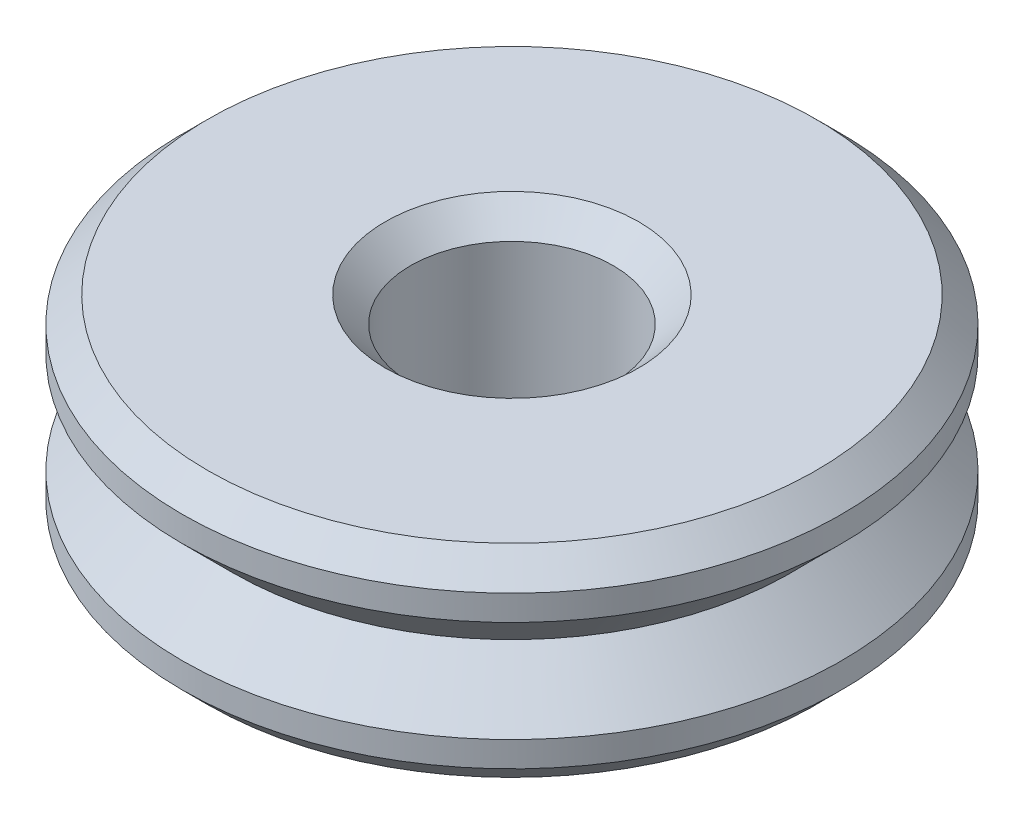
ISO-10303-21;
HEADER;
FILE_DESCRIPTION(('STEP AP214'),'2;1');
FILE_NAME('part.step','',(''),(''),'','','');
FILE_SCHEMA(('AUTOMOTIVE_DESIGN { 1 0 10303 214 1 1 1 1 }'));
ENDSEC;
DATA;
#1=APPLICATION_CONTEXT('core data for automotive mechanical design processes');
#2=APPLICATION_PROTOCOL_DEFINITION('international standard','automotive_design',2000,#1);
#3=PRODUCT_CONTEXT('',#1,'mechanical');
#4=PRODUCT('Part','Part','',(#3));
#5=PRODUCT_RELATED_PRODUCT_CATEGORY('part','',(#4));
#6=PRODUCT_DEFINITION_FORMATION('','',#4);
#7=PRODUCT_DEFINITION_CONTEXT('part definition',#1,'design');
#8=PRODUCT_DEFINITION('design','',#6,#7);
#9=PRODUCT_DEFINITION_SHAPE('','',#8);
#10=(LENGTH_UNIT() NAMED_UNIT(*) SI_UNIT(.MILLI.,.METRE.));
#11=(NAMED_UNIT(*) PLANE_ANGLE_UNIT() SI_UNIT($,.RADIAN.));
#12=(NAMED_UNIT(*) SI_UNIT($,.STERADIAN.) SOLID_ANGLE_UNIT());
#13=UNCERTAINTY_MEASURE_WITH_UNIT(LENGTH_MEASURE(1.E-05),#10,'distance_accuracy_value','');
#14=(GEOMETRIC_REPRESENTATION_CONTEXT(3) GLOBAL_UNCERTAINTY_ASSIGNED_CONTEXT((#13)) GLOBAL_UNIT_ASSIGNED_CONTEXT((#10,
#11,#12)) REPRESENTATION_CONTEXT('',''));
#15=CARTESIAN_POINT('',(0.,0.,0.));
#16=DIRECTION('',(0.,0.,1.));
#17=DIRECTION('',(1.,0.,0.));
#18=AXIS2_PLACEMENT_3D('',#15,#16,#17);
#19=CARTESIAN_POINT('',(0.,4.,0.));
#20=DIRECTION('',(0.,-1.,0.));
#21=DIRECTION('',(0.,0.,-1.));
#22=AXIS2_PLACEMENT_3D('',#19,#20,#21);
#23=CYLINDRICAL_SURFACE('',#22,6.5);
#24=CARTESIAN_POINT('',(0.,3.5,0.));
#25=DIRECTION('',(0.,1.,0.));
#26=DIRECTION('',(0.,0.,1.));
#27=AXIS2_PLACEMENT_3D('',#24,#25,#26);
#28=CIRCLE('',#27,6.5);
#29=CARTESIAN_POINT('',(0.,3.5,6.5));
#30=VERTEX_POINT('',#29);
#31=EDGE_CURVE('E10',#30,#30,#28,.F.);
#32=ORIENTED_EDGE('',*,*,#31,.T.);
#33=EDGE_LOOP('',(#32));
#34=FACE_BOUND('',#33,.T.);
#35=CARTESIAN_POINT('',(0.,3.,0.));
#36=DIRECTION('',(0.,1.,0.));
#37=DIRECTION('',(0.,0.,1.));
#38=AXIS2_PLACEMENT_3D('',#35,#36,#37);
#39=CIRCLE('',#38,6.5);
#40=CARTESIAN_POINT('',(0.,3.,6.5));
#41=VERTEX_POINT('',#40);
#42=EDGE_CURVE('E73',#41,#41,#39,.T.);
#43=ORIENTED_EDGE('',*,*,#42,.T.);
#44=EDGE_LOOP('',(#43));
#45=FACE_BOUND('',#44,.T.);
#46=ADVANCED_FACE('F35',(#34,#45),#23,.T.);
#47=CARTESIAN_POINT('',(0.,4.,0.));
#48=DIRECTION('',(0.,1.,0.));
#49=DIRECTION('',(0.,0.,1.));
#50=AXIS2_PLACEMENT_3D('',#47,#48,#49);
#51=PLANE('',#50);
#52=CARTESIAN_POINT('',(0.,4.,0.));
#53=DIRECTION('',(0.,1.,0.));
#54=DIRECTION('',(0.,0.,1.));
#55=AXIS2_PLACEMENT_3D('',#52,#53,#54);
#56=CIRCLE('',#55,5.99999999999999);
#57=CARTESIAN_POINT('',(0.,4.,5.99999999999999));
#58=VERTEX_POINT('',#57);
#59=EDGE_CURVE('E42',#58,#58,#56,.T.);
#60=ORIENTED_EDGE('',*,*,#59,.T.);
#61=EDGE_LOOP('',(#60));
#62=FACE_BOUND('',#61,.T.);
#63=CARTESIAN_POINT('',(0.,4.,0.));
#64=DIRECTION('',(0.,1.,0.));
#65=DIRECTION('',(0.,0.,1.));
#66=AXIS2_PLACEMENT_3D('',#63,#64,#65);
#67=CIRCLE('',#66,2.50000000000001);
#68=CARTESIAN_POINT('',(0.,4.,2.50000000000001));
#69=VERTEX_POINT('',#68);
#70=EDGE_CURVE('E46',#69,#69,#67,.F.);
#71=ORIENTED_EDGE('',*,*,#70,.T.);
#72=EDGE_LOOP('',(#71));
#73=FACE_BOUND('',#72,.T.);
#74=ADVANCED_FACE('F103',(#62,#73),#51,.T.);
#75=CARTESIAN_POINT('',(0.,0.,0.));
#76=DIRECTION('',(0.,1.,0.));
#77=DIRECTION('',(0.,0.,1.));
#78=AXIS2_PLACEMENT_3D('',#75,#76,#77);
#79=PLANE('',#78);
#80=CARTESIAN_POINT('',(0.,0.,0.));
#81=DIRECTION('',(0.,1.,0.));
#82=DIRECTION('',(0.,0.,1.));
#83=AXIS2_PLACEMENT_3D('',#80,#81,#82);
#84=CIRCLE('',#83,2.5);
#85=CARTESIAN_POINT('',(0.,0.,2.5));
#86=VERTEX_POINT('',#85);
#87=EDGE_CURVE('E61',#86,#86,#84,.T.);
#88=ORIENTED_EDGE('',*,*,#87,.T.);
#89=EDGE_LOOP('',(#88));
#90=FACE_BOUND('',#89,.T.);
#91=CARTESIAN_POINT('',(0.,0.,0.));
#92=DIRECTION('',(0.,1.,0.));
#93=DIRECTION('',(0.,0.,1.));
#94=AXIS2_PLACEMENT_3D('',#91,#92,#93);
#95=CIRCLE('',#94,5.99999999999999);
#96=CARTESIAN_POINT('',(0.,0.,5.99999999999999));
#97=VERTEX_POINT('',#96);
#98=EDGE_CURVE('E64',#97,#97,#95,.F.);
#99=ORIENTED_EDGE('',*,*,#98,.T.);
#100=EDGE_LOOP('',(#99));
#101=FACE_BOUND('',#100,.T.);
#102=ADVANCED_FACE('F94',(#90,#101),#79,.F.);
#103=CARTESIAN_POINT('',(0.,0.500000000000001,0.));
#104=DIRECTION('',(0.,1.,0.));
#105=DIRECTION('',(0.,0.,1.));
#106=AXIS2_PLACEMENT_3D('',#103,#104,#105);
#107=CIRCLE('',#106,6.5);
#108=CARTESIAN_POINT('',(0.,0.500000000000001,6.5));
#109=VERTEX_POINT('',#108);
#110=EDGE_CURVE('E50',#109,#109,#107,.T.);
#111=ORIENTED_EDGE('',*,*,#110,.T.);
#112=EDGE_LOOP('',(#111));
#113=FACE_BOUND('',#112,.T.);
#114=CARTESIAN_POINT('',(0.,1.,0.));
#115=DIRECTION('',(0.,1.,0.));
#116=DIRECTION('',(0.,0.,1.));
#117=AXIS2_PLACEMENT_3D('',#114,#115,#116);
#118=CIRCLE('',#117,6.5);
#119=CARTESIAN_POINT('',(0.,1.,6.5));
#120=VERTEX_POINT('',#119);
#121=EDGE_CURVE('E70',#120,#120,#118,.T.);
#122=ORIENTED_EDGE('',*,*,#121,.F.);
#123=EDGE_LOOP('',(#122));
#124=FACE_BOUND('',#123,.T.);
#125=ADVANCED_FACE('F92',(#113,#124),#23,.T.);
#126=CARTESIAN_POINT('',(0.,4.,0.));
#127=DIRECTION('',(0.,-1.,0.));
#128=DIRECTION('',(0.,0.,-1.));
#129=AXIS2_PLACEMENT_3D('',#126,#127,#128);
#130=CYLINDRICAL_SURFACE('',#129,2.);
#131=CARTESIAN_POINT('',(0.,0.500000000000002,0.));
#132=DIRECTION('',(0.,1.,0.));
#133=DIRECTION('',(0.,0.,1.));
#134=AXIS2_PLACEMENT_3D('',#131,#132,#133);
#135=CIRCLE('',#134,2.);
#136=CARTESIAN_POINT('',(0.,0.500000000000002,2.));
#137=VERTEX_POINT('',#136);
#138=EDGE_CURVE('E55',#137,#137,#135,.F.);
#139=ORIENTED_EDGE('',*,*,#138,.T.);
#140=EDGE_LOOP('',(#139));
#141=FACE_BOUND('',#140,.T.);
#142=CARTESIAN_POINT('',(0.,3.49999999999999,0.));
#143=DIRECTION('',(0.,1.,0.));
#144=DIRECTION('',(0.,0.,1.));
#145=AXIS2_PLACEMENT_3D('',#142,#143,#144);
#146=CIRCLE('',#145,2.);
#147=CARTESIAN_POINT('',(0.,3.49999999999999,2.));
#148=VERTEX_POINT('',#147);
#149=EDGE_CURVE('E58',#148,#148,#146,.T.);
#150=ORIENTED_EDGE('',*,*,#149,.T.);
#151=EDGE_LOOP('',(#150));
#152=FACE_BOUND('',#151,.T.);
#153=ADVANCED_FACE('F82',(#141,#152),#130,.F.);
#154=CARTESIAN_POINT('',(0.,2.,0.));
#155=DIRECTION('',(0.,1.,0.));
#156=DIRECTION('',(0.,0.,1.));
#157=AXIS2_PLACEMENT_3D('',#154,#155,#156);
#158=CONICAL_SURFACE('',#157,5.5,0.785398163397448);
#159=ORIENTED_EDGE('',*,*,#42,.F.);
#160=EDGE_LOOP('',(#159));
#161=FACE_BOUND('',#160,.T.);
#162=CARTESIAN_POINT('',(0.,2.,0.));
#163=DIRECTION('',(0.,1.,0.));
#164=DIRECTION('',(0.,0.,1.));
#165=AXIS2_PLACEMENT_3D('',#162,#163,#164);
#166=CIRCLE('',#165,5.5);
#167=CARTESIAN_POINT('',(0.,2.,5.5));
#168=VERTEX_POINT('',#167);
#169=EDGE_CURVE('E67',#168,#168,#166,.T.);
#170=ORIENTED_EDGE('',*,*,#169,.T.);
#171=EDGE_LOOP('',(#170));
#172=FACE_BOUND('',#171,.T.);
#173=ADVANCED_FACE('F78',(#161,#172),#158,.T.);
#174=CARTESIAN_POINT('',(0.,1.,0.));
#175=DIRECTION('',(0.,-1.,0.));
#176=DIRECTION('',(0.,0.,-1.));
#177=AXIS2_PLACEMENT_3D('',#174,#175,#176);
#178=CONICAL_SURFACE('',#177,6.5,0.785398163397448);
#179=ORIENTED_EDGE('',*,*,#169,.F.);
#180=EDGE_LOOP('',(#179));
#181=FACE_BOUND('',#180,.T.);
#182=ORIENTED_EDGE('',*,*,#121,.T.);
#183=EDGE_LOOP('',(#182));
#184=FACE_BOUND('',#183,.T.);
#185=ADVANCED_FACE('F81',(#181,#184),#178,.T.);
#186=CARTESIAN_POINT('',(0.,0.,0.));
#187=DIRECTION('',(0.,-1.,0.));
#188=DIRECTION('',(0.,0.,-1.));
#189=AXIS2_PLACEMENT_3D('',#186,#187,#188);
#190=CONICAL_SURFACE('',#189,2.5,0.785398163397448);
#191=ORIENTED_EDGE('',*,*,#138,.F.);
#192=EDGE_LOOP('',(#191));
#193=FACE_BOUND('',#192,.T.);
#194=ORIENTED_EDGE('',*,*,#87,.F.);
#195=EDGE_LOOP('',(#194));
#196=FACE_BOUND('',#195,.T.);
#197=ADVANCED_FACE('F88',(#193,#196),#190,.F.);
#198=CARTESIAN_POINT('',(0.,0.500000000000001,0.));
#199=DIRECTION('',(0.,1.,0.));
#200=DIRECTION('',(0.,0.,1.));
#201=AXIS2_PLACEMENT_3D('',#198,#199,#200);
#202=CONICAL_SURFACE('',#201,6.5,0.785398163397451);
#203=ORIENTED_EDGE('',*,*,#98,.F.);
#204=EDGE_LOOP('',(#203));
#205=FACE_BOUND('',#204,.T.);
#206=ORIENTED_EDGE('',*,*,#110,.F.);
#207=EDGE_LOOP('',(#206));
#208=FACE_BOUND('',#207,.T.);
#209=ADVANCED_FACE('F125',(#205,#208),#202,.T.);
#210=CARTESIAN_POINT('',(0.,4.,0.));
#211=DIRECTION('',(0.,-1.,0.));
#212=DIRECTION('',(0.,0.,-1.));
#213=AXIS2_PLACEMENT_3D('',#210,#211,#212);
#214=CONICAL_SURFACE('',#213,5.99999999999999,0.785398163397449);
#215=ORIENTED_EDGE('',*,*,#31,.F.);
#216=EDGE_LOOP('',(#215));
#217=FACE_BOUND('',#216,.T.);
#218=ORIENTED_EDGE('',*,*,#59,.F.);
#219=EDGE_LOOP('',(#218));
#220=FACE_BOUND('',#219,.T.);
#221=ADVANCED_FACE('F119',(#217,#220),#214,.T.);
#222=CARTESIAN_POINT('',(0.,3.49999999999999,0.));
#223=DIRECTION('',(0.,1.,0.));
#224=DIRECTION('',(0.,0.,1.));
#225=AXIS2_PLACEMENT_3D('',#222,#223,#224);
#226=CONICAL_SURFACE('',#225,2.,0.785398163397452);
#227=ORIENTED_EDGE('',*,*,#70,.F.);
#228=EDGE_LOOP('',(#227));
#229=FACE_BOUND('',#228,.T.);
#230=ORIENTED_EDGE('',*,*,#149,.F.);
#231=EDGE_LOOP('',(#230));
#232=FACE_BOUND('',#231,.T.);
#233=ADVANCED_FACE('F37',(#229,#232),#226,.F.);
#234=CLOSED_SHELL('',(#46,#74,#102,#125,#153,#173,#185,#197,#209,#221,#233));
#235=MANIFOLD_SOLID_BREP('B2',#234);
#236=ADVANCED_BREP_SHAPE_REPRESENTATION('',(#18,#235),#14);
#237=SHAPE_DEFINITION_REPRESENTATION(#9,#236);
ENDSEC;
END-ISO-10303-21;
